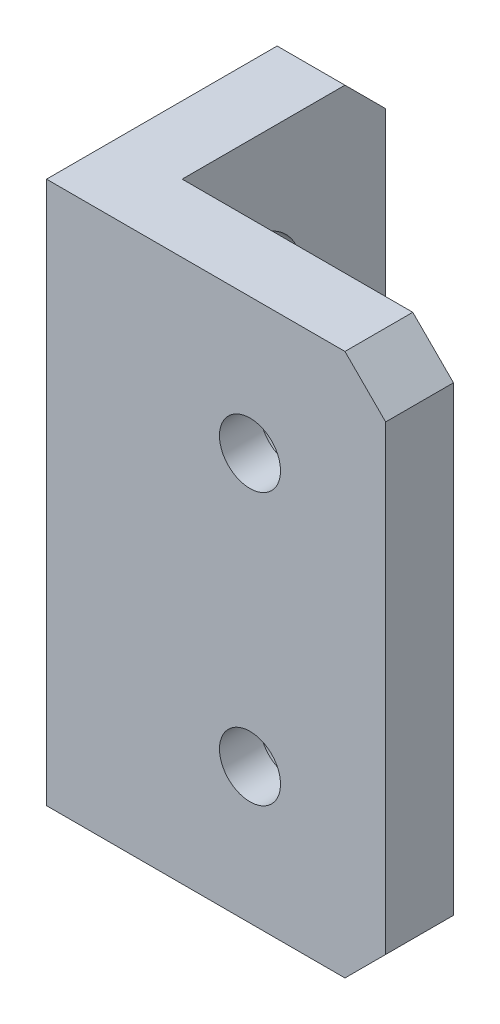
ISO-10303-21;
HEADER;
FILE_DESCRIPTION(('STEP AP214'),'2;1');
FILE_NAME('part.step','',(''),(''),'','','');
FILE_SCHEMA(('AUTOMOTIVE_DESIGN { 1 0 10303 214 1 1 1 1 }'));
ENDSEC;
DATA;
#1=APPLICATION_CONTEXT('core data for automotive mechanical design processes');
#2=APPLICATION_PROTOCOL_DEFINITION('international standard','automotive_design',2000,#1);
#3=PRODUCT_CONTEXT('',#1,'mechanical');
#4=PRODUCT('Part','Part','',(#3));
#5=PRODUCT_RELATED_PRODUCT_CATEGORY('part','',(#4));
#6=PRODUCT_DEFINITION_FORMATION('','',#4);
#7=PRODUCT_DEFINITION_CONTEXT('part definition',#1,'design');
#8=PRODUCT_DEFINITION('design','',#6,#7);
#9=PRODUCT_DEFINITION_SHAPE('','',#8);
#10=(LENGTH_UNIT() NAMED_UNIT(*) SI_UNIT(.MILLI.,.METRE.));
#11=(NAMED_UNIT(*) PLANE_ANGLE_UNIT() SI_UNIT($,.RADIAN.));
#12=(NAMED_UNIT(*) SI_UNIT($,.STERADIAN.) SOLID_ANGLE_UNIT());
#13=UNCERTAINTY_MEASURE_WITH_UNIT(LENGTH_MEASURE(1.E-05),#10,'distance_accuracy_value','');
#14=(GEOMETRIC_REPRESENTATION_CONTEXT(3) GLOBAL_UNCERTAINTY_ASSIGNED_CONTEXT((#13)) GLOBAL_UNIT_ASSIGNED_CONTEXT((#10,
#11,#12)) REPRESENTATION_CONTEXT('',''));
#15=CARTESIAN_POINT('',(0.,0.,0.));
#16=DIRECTION('',(0.,0.,1.));
#17=DIRECTION('',(1.,0.,0.));
#18=AXIS2_PLACEMENT_3D('',#15,#16,#17);
#19=CARTESIAN_POINT('',(25.001,30.,-10.));
#20=DIRECTION('',(-1.,0.,0.));
#21=DIRECTION('',(0.,0.,1.));
#22=AXIS2_PLACEMENT_3D('',#19,#20,#21);
#23=CYLINDRICAL_SURFACE('',#22,2.25);
#24=CARTESIAN_POINT('',(0.,30.,-10.));
#25=DIRECTION('',(-1.,0.,0.));
#26=DIRECTION('',(0.,0.,-1.));
#27=AXIS2_PLACEMENT_3D('',#24,#25,#26);
#28=CIRCLE('',#27,2.25);
#29=CARTESIAN_POINT('',(0.,30.,-12.25));
#30=VERTEX_POINT('',#29);
#31=EDGE_CURVE('E343',#30,#30,#28,.T.);
#32=ORIENTED_EDGE('',*,*,#31,.T.);
#33=EDGE_LOOP('',(#32));
#34=FACE_BOUND('',#33,.T.);
#35=CARTESIAN_POINT('',(3.,30.,-10.));
#36=DIRECTION('',(1.,0.,0.));
#37=DIRECTION('',(0.,0.,-1.));
#38=AXIS2_PLACEMENT_3D('',#35,#36,#37);
#39=CIRCLE('',#38,2.25);
#40=CARTESIAN_POINT('',(3.,30.,-12.25));
#41=VERTEX_POINT('',#40);
#42=EDGE_CURVE('E157',#41,#41,#39,.F.);
#43=ORIENTED_EDGE('',*,*,#42,.F.);
#44=EDGE_LOOP('',(#43));
#45=FACE_BOUND('',#44,.T.);
#46=ADVANCED_FACE('F35',(#34,#45),#23,.F.);
#47=CARTESIAN_POINT('',(15.,10.,0.00100000000000013));
#48=DIRECTION('',(0.,0.,-1.));
#49=DIRECTION('',(-1.,0.,0.));
#50=AXIS2_PLACEMENT_3D('',#47,#48,#49);
#51=CYLINDRICAL_SURFACE('',#50,2.25);
#52=CARTESIAN_POINT('',(15.,10.,0.));
#53=DIRECTION('',(0.,0.,-1.));
#54=DIRECTION('',(-1.,0.,0.));
#55=AXIS2_PLACEMENT_3D('',#52,#53,#54);
#56=CIRCLE('',#55,2.25);
#57=CARTESIAN_POINT('',(12.75,10.,0.));
#58=VERTEX_POINT('',#57);
#59=EDGE_CURVE('E340',#58,#58,#56,.F.);
#60=ORIENTED_EDGE('',*,*,#59,.T.);
#61=EDGE_LOOP('',(#60));
#62=FACE_BOUND('',#61,.T.);
#63=CARTESIAN_POINT('',(15.,10.,-3.));
#64=DIRECTION('',(0.,0.,-1.));
#65=DIRECTION('',(-1.,0.,0.));
#66=AXIS2_PLACEMENT_3D('',#63,#64,#65);
#67=CIRCLE('',#66,2.25);
#68=CARTESIAN_POINT('',(12.75,10.,-3.));
#69=VERTEX_POINT('',#68);
#70=EDGE_CURVE('E146',#69,#69,#67,.F.);
#71=ORIENTED_EDGE('',*,*,#70,.F.);
#72=EDGE_LOOP('',(#71));
#73=FACE_BOUND('',#72,.T.);
#74=ADVANCED_FACE('F243',(#62,#73),#51,.F.);
#75=CARTESIAN_POINT('',(0.,40.,0.));
#76=DIRECTION('',(1.,0.,0.));
#77=DIRECTION('',(0.,0.,-1.));
#78=AXIS2_PLACEMENT_3D('',#75,#76,#77);
#79=PLANE('',#78);
#80=CARTESIAN_POINT('',(0.,10.,-10.));
#81=DIRECTION('',(-1.,0.,0.));
#82=DIRECTION('',(0.,0.,1.));
#83=AXIS2_PLACEMENT_3D('',#80,#81,#82);
#84=CIRCLE('',#83,2.25);
#85=CARTESIAN_POINT('',(0.,10.,-7.75));
#86=VERTEX_POINT('',#85);
#87=EDGE_CURVE('E231',#86,#86,#84,.T.);
#88=ORIENTED_EDGE('',*,*,#87,.F.);
#89=EDGE_LOOP('',(#88));
#90=FACE_BOUND('',#89,.T.);
#91=ORIENTED_EDGE('',*,*,#31,.F.);
#92=EDGE_LOOP('',(#91));
#93=FACE_BOUND('',#92,.T.);
#94=DIRECTION('',(0.,0.,1.));
#95=VECTOR('',#94,1.);
#96=CARTESIAN_POINT('',(0.,40.,0.));
#97=LINE('',#96,#95);
#98=CARTESIAN_POINT('',(0.,40.,-17.));
#99=VERTEX_POINT('',#98);
#100=CARTESIAN_POINT('',(0.,40.,0.));
#101=VERTEX_POINT('',#100);
#102=EDGE_CURVE('E115',#99,#101,#97,.T.);
#103=ORIENTED_EDGE('',*,*,#102,.F.);
#104=DIRECTION('',(0.,0.707106781186548,0.707106781186547));
#105=VECTOR('',#104,1.);
#106=CARTESIAN_POINT('',(0.,40.,-17.));
#107=LINE('',#106,#105);
#108=CARTESIAN_POINT('',(0.,37.,-20.));
#109=VERTEX_POINT('',#108);
#110=EDGE_CURVE('E165',#99,#109,#107,.F.);
#111=ORIENTED_EDGE('',*,*,#110,.T.);
#112=DIRECTION('',(0.,-1.,0.));
#113=VECTOR('',#112,1.);
#114=CARTESIAN_POINT('',(0.,40.,-20.));
#115=LINE('',#114,#113);
#116=CARTESIAN_POINT('',(0.,3.00000000000001,-20.));
#117=VERTEX_POINT('',#116);
#118=EDGE_CURVE('E207',#109,#117,#115,.T.);
#119=ORIENTED_EDGE('',*,*,#118,.T.);
#120=DIRECTION('',(0.,-0.707106781186547,0.707106781186548));
#121=VECTOR('',#120,1.);
#122=CARTESIAN_POINT('',(0.,3.00000000000001,-20.));
#123=LINE('',#122,#121);
#124=CARTESIAN_POINT('',(0.,0.,-17.));
#125=VERTEX_POINT('',#124);
#126=EDGE_CURVE('E163',#117,#125,#123,.T.);
#127=ORIENTED_EDGE('',*,*,#126,.T.);
#128=DIRECTION('',(0.,0.,1.));
#129=VECTOR('',#128,1.);
#130=CARTESIAN_POINT('',(0.,0.,0.));
#131=LINE('',#130,#129);
#132=CARTESIAN_POINT('',(0.,0.,0.));
#133=VERTEX_POINT('',#132);
#134=EDGE_CURVE('E137',#125,#133,#131,.T.);
#135=ORIENTED_EDGE('',*,*,#134,.T.);
#136=DIRECTION('',(0.,-1.,0.));
#137=VECTOR('',#136,1.);
#138=CARTESIAN_POINT('',(0.,40.,0.));
#139=LINE('',#138,#137);
#140=EDGE_CURVE('E130',#101,#133,#139,.T.);
#141=ORIENTED_EDGE('',*,*,#140,.F.);
#142=EDGE_LOOP('',(#103,#111,#119,#127,#135,#141));
#143=FACE_BOUND('',#142,.T.);
#144=ADVANCED_FACE('F135',(#90,#93,#143),#79,.F.);
#145=CARTESIAN_POINT('',(0.,40.,0.));
#146=DIRECTION('',(0.,0.,-1.));
#147=DIRECTION('',(-1.,0.,0.));
#148=AXIS2_PLACEMENT_3D('',#145,#146,#147);
#149=PLANE('',#148);
#150=ORIENTED_EDGE('',*,*,#59,.F.);
#151=EDGE_LOOP('',(#150));
#152=FACE_BOUND('',#151,.T.);
#153=CARTESIAN_POINT('',(15.,30.,0.));
#154=DIRECTION('',(0.,0.,-1.));
#155=DIRECTION('',(-1.,0.,0.));
#156=AXIS2_PLACEMENT_3D('',#153,#154,#155);
#157=CIRCLE('',#156,2.25);
#158=CARTESIAN_POINT('',(12.75,30.,0.));
#159=VERTEX_POINT('',#158);
#160=EDGE_CURVE('E153',#159,#159,#157,.F.);
#161=ORIENTED_EDGE('',*,*,#160,.F.);
#162=EDGE_LOOP('',(#161));
#163=FACE_BOUND('',#162,.T.);
#164=DIRECTION('',(0.,-1.,0.));
#165=VECTOR('',#164,1.);
#166=CARTESIAN_POINT('',(25.,40.,0.));
#167=LINE('',#166,#165);
#168=CARTESIAN_POINT('',(25.,37.,0.));
#169=VERTEX_POINT('',#168);
#170=CARTESIAN_POINT('',(25.,3.00000000000001,0.));
#171=VERTEX_POINT('',#170);
#172=EDGE_CURVE('E139',#169,#171,#167,.T.);
#173=ORIENTED_EDGE('',*,*,#172,.F.);
#174=DIRECTION('',(0.707106781186547,-0.707106781186548,0.));
#175=VECTOR('',#174,1.);
#176=CARTESIAN_POINT('',(22.,40.,0.));
#177=LINE('',#176,#175);
#178=CARTESIAN_POINT('',(22.,40.,0.));
#179=VERTEX_POINT('',#178);
#180=EDGE_CURVE('E132',#169,#179,#177,.F.);
#181=ORIENTED_EDGE('',*,*,#180,.T.);
#182=DIRECTION('',(1.,0.,0.));
#183=VECTOR('',#182,1.);
#184=CARTESIAN_POINT('',(0.,40.,0.));
#185=LINE('',#184,#183);
#186=EDGE_CURVE('E120',#101,#179,#185,.T.);
#187=ORIENTED_EDGE('',*,*,#186,.F.);
#188=ORIENTED_EDGE('',*,*,#140,.T.);
#189=DIRECTION('',(1.,0.,0.));
#190=VECTOR('',#189,1.);
#191=CARTESIAN_POINT('',(0.,0.,0.));
#192=LINE('',#191,#190);
#193=CARTESIAN_POINT('',(22.,0.,0.));
#194=VERTEX_POINT('',#193);
#195=EDGE_CURVE('E230',#133,#194,#192,.T.);
#196=ORIENTED_EDGE('',*,*,#195,.T.);
#197=DIRECTION('',(0.707106781186548,0.707106781186547,0.));
#198=VECTOR('',#197,1.);
#199=CARTESIAN_POINT('',(25.,3.00000000000001,0.));
#200=LINE('',#199,#198);
#201=EDGE_CURVE('E56',#194,#171,#200,.T.);
#202=ORIENTED_EDGE('',*,*,#201,.T.);
#203=EDGE_LOOP('',(#173,#181,#187,#188,#196,#202));
#204=FACE_BOUND('',#203,.T.);
#205=ADVANCED_FACE('F129',(#152,#163,#204),#149,.F.);
#206=CARTESIAN_POINT('',(25.,40.,0.));
#207=DIRECTION('',(-1.,0.,0.));
#208=DIRECTION('',(0.,0.,1.));
#209=AXIS2_PLACEMENT_3D('',#206,#207,#208);
#210=PLANE('',#209);
#211=DIRECTION('',(0.,-1.,0.));
#212=VECTOR('',#211,1.);
#213=CARTESIAN_POINT('',(25.,40.,-5.));
#214=LINE('',#213,#212);
#215=CARTESIAN_POINT('',(25.,37.,-5.));
#216=VERTEX_POINT('',#215);
#217=CARTESIAN_POINT('',(25.,3.00000000000001,-5.));
#218=VERTEX_POINT('',#217);
#219=EDGE_CURVE('E142',#216,#218,#214,.T.);
#220=ORIENTED_EDGE('',*,*,#219,.F.);
#221=DIRECTION('',(0.,0.,1.));
#222=VECTOR('',#221,1.);
#223=CARTESIAN_POINT('',(25.,37.,0.));
#224=LINE('',#223,#222);
#225=EDGE_CURVE('E183',#216,#169,#224,.T.);
#226=ORIENTED_EDGE('',*,*,#225,.T.);
#227=ORIENTED_EDGE('',*,*,#172,.T.);
#228=DIRECTION('',(0.,0.,-1.));
#229=VECTOR('',#228,1.);
#230=CARTESIAN_POINT('',(25.,3.00000000000001,-5.));
#231=LINE('',#230,#229);
#232=EDGE_CURVE('E180',#171,#218,#231,.T.);
#233=ORIENTED_EDGE('',*,*,#232,.T.);
#234=EDGE_LOOP('',(#220,#226,#227,#233));
#235=FACE_BOUND('',#234,.T.);
#236=ADVANCED_FACE('F223',(#235),#210,.F.);
#237=CARTESIAN_POINT('',(5.,40.,-5.));
#238=DIRECTION('',(0.,0.,1.));
#239=DIRECTION('',(1.,0.,0.));
#240=AXIS2_PLACEMENT_3D('',#237,#238,#239);
#241=PLANE('',#240);
#242=CARTESIAN_POINT('',(15.,10.,-5.));
#243=DIRECTION('',(0.,0.,-1.));
#244=DIRECTION('',(-1.,0.,0.));
#245=AXIS2_PLACEMENT_3D('',#242,#243,#244);
#246=CIRCLE('',#245,3.75);
#247=CARTESIAN_POINT('',(11.25,10.,-5.));
#248=VERTEX_POINT('',#247);
#249=EDGE_CURVE('E358',#248,#248,#246,.T.);
#250=ORIENTED_EDGE('',*,*,#249,.F.);
#251=EDGE_LOOP('',(#250));
#252=FACE_BOUND('',#251,.T.);
#253=CARTESIAN_POINT('',(15.,30.,-5.));
#254=DIRECTION('',(0.,0.,-1.));
#255=DIRECTION('',(1.,0.,0.));
#256=AXIS2_PLACEMENT_3D('',#253,#254,#255);
#257=CIRCLE('',#256,3.75);
#258=CARTESIAN_POINT('',(18.75,30.,-5.));
#259=VERTEX_POINT('',#258);
#260=EDGE_CURVE('E160',#259,#259,#257,.T.);
#261=ORIENTED_EDGE('',*,*,#260,.F.);
#262=EDGE_LOOP('',(#261));
#263=FACE_BOUND('',#262,.T.);
#264=DIRECTION('',(-1.,0.,0.));
#265=VECTOR('',#264,1.);
#266=CARTESIAN_POINT('',(5.,40.,-5.));
#267=LINE('',#266,#265);
#268=CARTESIAN_POINT('',(22.,40.,-5.));
#269=VERTEX_POINT('',#268);
#270=CARTESIAN_POINT('',(5.,40.,-5.));
#271=VERTEX_POINT('',#270);
#272=EDGE_CURVE('E133',#269,#271,#267,.T.);
#273=ORIENTED_EDGE('',*,*,#272,.F.);
#274=DIRECTION('',(-0.707106781186547,0.707106781186548,0.));
#275=VECTOR('',#274,1.);
#276=CARTESIAN_POINT('',(22.,40.,-5.));
#277=LINE('',#276,#275);
#278=EDGE_CURVE('E178',#269,#216,#277,.F.);
#279=ORIENTED_EDGE('',*,*,#278,.T.);
#280=ORIENTED_EDGE('',*,*,#219,.T.);
#281=DIRECTION('',(-0.707106781186548,-0.707106781186547,0.));
#282=VECTOR('',#281,1.);
#283=CARTESIAN_POINT('',(25.,3.00000000000001,-5.));
#284=LINE('',#283,#282);
#285=CARTESIAN_POINT('',(22.,0.,-5.));
#286=VERTEX_POINT('',#285);
#287=EDGE_CURVE('E176',#218,#286,#284,.T.);
#288=ORIENTED_EDGE('',*,*,#287,.T.);
#289=DIRECTION('',(-1.,0.,0.));
#290=VECTOR('',#289,1.);
#291=CARTESIAN_POINT('',(5.,0.,-5.));
#292=LINE('',#291,#290);
#293=CARTESIAN_POINT('',(5.,0.,-5.));
#294=VERTEX_POINT('',#293);
#295=EDGE_CURVE('E200',#286,#294,#292,.T.);
#296=ORIENTED_EDGE('',*,*,#295,.T.);
#297=DIRECTION('',(0.,-1.,0.));
#298=VECTOR('',#297,1.);
#299=CARTESIAN_POINT('',(5.,40.,-5.));
#300=LINE('',#299,#298);
#301=EDGE_CURVE('E199',#271,#294,#300,.T.);
#302=ORIENTED_EDGE('',*,*,#301,.F.);
#303=EDGE_LOOP('',(#273,#279,#280,#288,#296,#302));
#304=FACE_BOUND('',#303,.T.);
#305=ADVANCED_FACE('F220',(#252,#263,#304),#241,.F.);
#306=CARTESIAN_POINT('',(5.,40.,-5.));
#307=DIRECTION('',(-1.,0.,0.));
#308=DIRECTION('',(0.,0.,1.));
#309=AXIS2_PLACEMENT_3D('',#306,#307,#308);
#310=PLANE('',#309);
#311=CARTESIAN_POINT('',(5.,30.,-10.));
#312=DIRECTION('',(1.,0.,0.));
#313=DIRECTION('',(0.,0.,-1.));
#314=AXIS2_PLACEMENT_3D('',#311,#312,#313);
#315=CIRCLE('',#314,3.75);
#316=CARTESIAN_POINT('',(5.,30.,-13.75));
#317=VERTEX_POINT('',#316);
#318=EDGE_CURVE('E369',#317,#317,#315,.T.);
#319=ORIENTED_EDGE('',*,*,#318,.F.);
#320=EDGE_LOOP('',(#319));
#321=FACE_BOUND('',#320,.T.);
#322=CARTESIAN_POINT('',(5.,10.,-10.));
#323=DIRECTION('',(1.,0.,0.));
#324=DIRECTION('',(0.,0.,1.));
#325=AXIS2_PLACEMENT_3D('',#322,#323,#324);
#326=CIRCLE('',#325,3.75);
#327=CARTESIAN_POINT('',(5.,10.,-6.25));
#328=VERTEX_POINT('',#327);
#329=EDGE_CURVE('E363',#328,#328,#326,.T.);
#330=ORIENTED_EDGE('',*,*,#329,.F.);
#331=EDGE_LOOP('',(#330));
#332=FACE_BOUND('',#331,.T.);
#333=DIRECTION('',(0.,-1.,0.));
#334=VECTOR('',#333,1.);
#335=CARTESIAN_POINT('',(5.,40.,-20.));
#336=LINE('',#335,#334);
#337=CARTESIAN_POINT('',(5.,37.,-20.));
#338=VERTEX_POINT('',#337);
#339=CARTESIAN_POINT('',(5.,3.00000000000001,-20.));
#340=VERTEX_POINT('',#339);
#341=EDGE_CURVE('E209',#338,#340,#336,.T.);
#342=ORIENTED_EDGE('',*,*,#341,.F.);
#343=DIRECTION('',(0.,-0.707106781186548,-0.707106781186547));
#344=VECTOR('',#343,1.);
#345=CARTESIAN_POINT('',(5.,40.,-17.));
#346=LINE('',#345,#344);
#347=CARTESIAN_POINT('',(5.,40.,-17.));
#348=VERTEX_POINT('',#347);
#349=EDGE_CURVE('E174',#338,#348,#346,.F.);
#350=ORIENTED_EDGE('',*,*,#349,.T.);
#351=DIRECTION('',(0.,0.,-1.));
#352=VECTOR('',#351,1.);
#353=CARTESIAN_POINT('',(5.,40.,-5.));
#354=LINE('',#353,#352);
#355=EDGE_CURVE('E210',#271,#348,#354,.T.);
#356=ORIENTED_EDGE('',*,*,#355,.F.);
#357=ORIENTED_EDGE('',*,*,#301,.T.);
#358=DIRECTION('',(0.,0.,-1.));
#359=VECTOR('',#358,1.);
#360=CARTESIAN_POINT('',(5.,0.,-5.));
#361=LINE('',#360,#359);
#362=CARTESIAN_POINT('',(5.,0.,-17.));
#363=VERTEX_POINT('',#362);
#364=EDGE_CURVE('E126',#294,#363,#361,.T.);
#365=ORIENTED_EDGE('',*,*,#364,.T.);
#366=DIRECTION('',(0.,0.707106781186547,-0.707106781186548));
#367=VECTOR('',#366,1.);
#368=CARTESIAN_POINT('',(5.,3.00000000000001,-20.));
#369=LINE('',#368,#367);
#370=EDGE_CURVE('E172',#363,#340,#369,.T.);
#371=ORIENTED_EDGE('',*,*,#370,.T.);
#372=EDGE_LOOP('',(#342,#350,#356,#357,#365,#371));
#373=FACE_BOUND('',#372,.T.);
#374=ADVANCED_FACE('F195',(#321,#332,#373),#310,.F.);
#375=CARTESIAN_POINT('',(0.,40.,-20.));
#376=DIRECTION('',(0.,0.,1.));
#377=DIRECTION('',(1.,0.,0.));
#378=AXIS2_PLACEMENT_3D('',#375,#376,#377);
#379=PLANE('',#378);
#380=ORIENTED_EDGE('',*,*,#118,.F.);
#381=DIRECTION('',(1.,0.,0.));
#382=VECTOR('',#381,1.);
#383=CARTESIAN_POINT('',(0.,37.,-20.));
#384=LINE('',#383,#382);
#385=EDGE_CURVE('E170',#109,#338,#384,.T.);
#386=ORIENTED_EDGE('',*,*,#385,.T.);
#387=ORIENTED_EDGE('',*,*,#341,.T.);
#388=DIRECTION('',(-1.,0.,0.));
#389=VECTOR('',#388,1.);
#390=CARTESIAN_POINT('',(0.,3.00000000000001,-20.));
#391=LINE('',#390,#389);
#392=EDGE_CURVE('E167',#340,#117,#391,.T.);
#393=ORIENTED_EDGE('',*,*,#392,.T.);
#394=EDGE_LOOP('',(#380,#386,#387,#393));
#395=FACE_BOUND('',#394,.T.);
#396=ADVANCED_FACE('F206',(#395),#379,.F.);
#397=CARTESIAN_POINT('',(0.,40.,0.));
#398=DIRECTION('',(0.,-1.,0.));
#399=DIRECTION('',(0.,0.,-1.));
#400=AXIS2_PLACEMENT_3D('',#397,#398,#399);
#401=PLANE('',#400);
#402=ORIENTED_EDGE('',*,*,#355,.T.);
#403=DIRECTION('',(-1.,0.,0.));
#404=VECTOR('',#403,1.);
#405=CARTESIAN_POINT('',(0.,40.,-17.));
#406=LINE('',#405,#404);
#407=EDGE_CURVE('E123',#348,#99,#406,.T.);
#408=ORIENTED_EDGE('',*,*,#407,.T.);
#409=ORIENTED_EDGE('',*,*,#102,.T.);
#410=ORIENTED_EDGE('',*,*,#186,.T.);
#411=DIRECTION('',(0.,0.,-1.));
#412=VECTOR('',#411,1.);
#413=CARTESIAN_POINT('',(22.,40.,0.));
#414=LINE('',#413,#412);
#415=EDGE_CURVE('E138',#179,#269,#414,.T.);
#416=ORIENTED_EDGE('',*,*,#415,.T.);
#417=ORIENTED_EDGE('',*,*,#272,.T.);
#418=EDGE_LOOP('',(#402,#408,#409,#410,#416,#417));
#419=FACE_BOUND('',#418,.T.);
#420=ADVANCED_FACE('F118',(#419),#401,.F.);
#421=CARTESIAN_POINT('',(0.,0.,0.));
#422=DIRECTION('',(0.,-1.,0.));
#423=DIRECTION('',(0.,0.,-1.));
#424=AXIS2_PLACEMENT_3D('',#421,#422,#423);
#425=PLANE('',#424);
#426=ORIENTED_EDGE('',*,*,#295,.F.);
#427=DIRECTION('',(0.,0.,1.));
#428=VECTOR('',#427,1.);
#429=CARTESIAN_POINT('',(22.,0.,0.));
#430=LINE('',#429,#428);
#431=EDGE_CURVE('E11',#286,#194,#430,.T.);
#432=ORIENTED_EDGE('',*,*,#431,.T.);
#433=ORIENTED_EDGE('',*,*,#195,.F.);
#434=ORIENTED_EDGE('',*,*,#134,.F.);
#435=DIRECTION('',(1.,0.,0.));
#436=VECTOR('',#435,1.);
#437=CARTESIAN_POINT('',(5.,0.,-17.));
#438=LINE('',#437,#436);
#439=EDGE_CURVE('E44',#125,#363,#438,.T.);
#440=ORIENTED_EDGE('',*,*,#439,.T.);
#441=ORIENTED_EDGE('',*,*,#364,.F.);
#442=EDGE_LOOP('',(#426,#432,#433,#434,#440,#441));
#443=FACE_BOUND('',#442,.T.);
#444=ADVANCED_FACE('F189',(#443),#425,.T.);
#445=CARTESIAN_POINT('',(25.001,10.,-10.));
#446=DIRECTION('',(-1.,0.,0.));
#447=DIRECTION('',(0.,0.,1.));
#448=AXIS2_PLACEMENT_3D('',#445,#446,#447);
#449=CYLINDRICAL_SURFACE('',#448,2.25);
#450=CARTESIAN_POINT('',(3.,10.,-10.));
#451=DIRECTION('',(-1.,0.,0.));
#452=DIRECTION('',(0.,0.,1.));
#453=AXIS2_PLACEMENT_3D('',#450,#451,#452);
#454=CIRCLE('',#453,2.25);
#455=CARTESIAN_POINT('',(3.,10.,-7.75));
#456=VERTEX_POINT('',#455);
#457=EDGE_CURVE('E154',#456,#456,#454,.F.);
#458=ORIENTED_EDGE('',*,*,#457,.T.);
#459=EDGE_LOOP('',(#458));
#460=FACE_BOUND('',#459,.T.);
#461=ORIENTED_EDGE('',*,*,#87,.T.);
#462=EDGE_LOOP('',(#461));
#463=FACE_BOUND('',#462,.T.);
#464=ADVANCED_FACE('F255',(#460,#463),#449,.F.);
#465=CARTESIAN_POINT('',(15.,30.,0.00100000000000013));
#466=DIRECTION('',(0.,0.,-1.));
#467=DIRECTION('',(-1.,0.,0.));
#468=AXIS2_PLACEMENT_3D('',#465,#466,#467);
#469=CYLINDRICAL_SURFACE('',#468,2.25);
#470=CARTESIAN_POINT('',(15.,30.,-3.));
#471=DIRECTION('',(0.,0.,1.));
#472=DIRECTION('',(1.,0.,0.));
#473=AXIS2_PLACEMENT_3D('',#470,#471,#472);
#474=CIRCLE('',#473,2.25);
#475=CARTESIAN_POINT('',(17.25,30.,-3.));
#476=VERTEX_POINT('',#475);
#477=EDGE_CURVE('E149',#476,#476,#474,.F.);
#478=ORIENTED_EDGE('',*,*,#477,.T.);
#479=EDGE_LOOP('',(#478));
#480=FACE_BOUND('',#479,.T.);
#481=ORIENTED_EDGE('',*,*,#160,.T.);
#482=EDGE_LOOP('',(#481));
#483=FACE_BOUND('',#482,.T.);
#484=ADVANCED_FACE('F318',(#480,#483),#469,.F.);
#485=CARTESIAN_POINT('',(15.,10.,-3.));
#486=DIRECTION('',(0.,0.,-1.));
#487=DIRECTION('',(-1.,0.,0.));
#488=AXIS2_PLACEMENT_3D('',#485,#486,#487);
#489=PLANE('',#488);
#490=CARTESIAN_POINT('',(15.,10.,-3.));
#491=DIRECTION('',(0.,0.,-1.));
#492=DIRECTION('',(-1.,0.,0.));
#493=AXIS2_PLACEMENT_3D('',#490,#491,#492);
#494=CIRCLE('',#493,3.75);
#495=CARTESIAN_POINT('',(11.25,10.,-3.));
#496=VERTEX_POINT('',#495);
#497=EDGE_CURVE('E150',#496,#496,#494,.T.);
#498=ORIENTED_EDGE('',*,*,#497,.T.);
#499=EDGE_LOOP('',(#498));
#500=FACE_BOUND('',#499,.T.);
#501=ORIENTED_EDGE('',*,*,#70,.T.);
#502=EDGE_LOOP('',(#501));
#503=FACE_BOUND('',#502,.T.);
#504=ADVANCED_FACE('F314',(#500,#503),#489,.T.);
#505=CARTESIAN_POINT('',(15.,10.,-3.));
#506=DIRECTION('',(0.,0.,-1.));
#507=DIRECTION('',(-1.,0.,0.));
#508=AXIS2_PLACEMENT_3D('',#505,#506,#507);
#509=CYLINDRICAL_SURFACE('',#508,3.75);
#510=ORIENTED_EDGE('',*,*,#497,.F.);
#511=EDGE_LOOP('',(#510));
#512=FACE_BOUND('',#511,.T.);
#513=ORIENTED_EDGE('',*,*,#249,.T.);
#514=EDGE_LOOP('',(#513));
#515=FACE_BOUND('',#514,.T.);
#516=ADVANCED_FACE('F317',(#512,#515),#509,.F.);
#517=CARTESIAN_POINT('',(15.,30.,-3.));
#518=DIRECTION('',(0.,0.,1.));
#519=DIRECTION('',(1.,0.,0.));
#520=AXIS2_PLACEMENT_3D('',#517,#518,#519);
#521=PLANE('',#520);
#522=CARTESIAN_POINT('',(15.,30.,-3.));
#523=DIRECTION('',(0.,0.,-1.));
#524=DIRECTION('',(1.,0.,0.));
#525=AXIS2_PLACEMENT_3D('',#522,#523,#524);
#526=CIRCLE('',#525,3.75);
#527=CARTESIAN_POINT('',(18.75,30.,-3.));
#528=VERTEX_POINT('',#527);
#529=EDGE_CURVE('E355',#528,#528,#526,.T.);
#530=ORIENTED_EDGE('',*,*,#529,.T.);
#531=EDGE_LOOP('',(#530));
#532=FACE_BOUND('',#531,.T.);
#533=ORIENTED_EDGE('',*,*,#477,.F.);
#534=EDGE_LOOP('',(#533));
#535=FACE_BOUND('',#534,.T.);
#536=ADVANCED_FACE('F322',(#532,#535),#521,.F.);
#537=CARTESIAN_POINT('',(15.,30.,-3.));
#538=DIRECTION('',(0.,0.,-1.));
#539=DIRECTION('',(-1.,0.,0.));
#540=AXIS2_PLACEMENT_3D('',#537,#538,#539);
#541=CYLINDRICAL_SURFACE('',#540,3.75);
#542=ORIENTED_EDGE('',*,*,#529,.F.);
#543=EDGE_LOOP('',(#542));
#544=FACE_BOUND('',#543,.T.);
#545=ORIENTED_EDGE('',*,*,#260,.T.);
#546=EDGE_LOOP('',(#545));
#547=FACE_BOUND('',#546,.T.);
#548=ADVANCED_FACE('F309',(#544,#547),#541,.F.);
#549=CARTESIAN_POINT('',(3.,10.,-10.));
#550=DIRECTION('',(-1.,0.,0.));
#551=DIRECTION('',(0.,0.,1.));
#552=AXIS2_PLACEMENT_3D('',#549,#550,#551);
#553=PLANE('',#552);
#554=CARTESIAN_POINT('',(3.,10.,-10.));
#555=DIRECTION('',(1.,0.,0.));
#556=DIRECTION('',(0.,0.,1.));
#557=AXIS2_PLACEMENT_3D('',#554,#555,#556);
#558=CIRCLE('',#557,3.75);
#559=CARTESIAN_POINT('',(3.,10.,-6.25));
#560=VERTEX_POINT('',#559);
#561=EDGE_CURVE('E366',#560,#560,#558,.T.);
#562=ORIENTED_EDGE('',*,*,#561,.T.);
#563=EDGE_LOOP('',(#562));
#564=FACE_BOUND('',#563,.T.);
#565=ORIENTED_EDGE('',*,*,#457,.F.);
#566=EDGE_LOOP('',(#565));
#567=FACE_BOUND('',#566,.T.);
#568=ADVANCED_FACE('F306',(#564,#567),#553,.F.);
#569=CARTESIAN_POINT('',(3.,10.,-10.));
#570=DIRECTION('',(1.,0.,0.));
#571=DIRECTION('',(0.,0.,-1.));
#572=AXIS2_PLACEMENT_3D('',#569,#570,#571);
#573=CYLINDRICAL_SURFACE('',#572,3.75);
#574=ORIENTED_EDGE('',*,*,#561,.F.);
#575=EDGE_LOOP('',(#574));
#576=FACE_BOUND('',#575,.T.);
#577=ORIENTED_EDGE('',*,*,#329,.T.);
#578=EDGE_LOOP('',(#577));
#579=FACE_BOUND('',#578,.T.);
#580=ADVANCED_FACE('F300',(#576,#579),#573,.F.);
#581=CARTESIAN_POINT('',(3.,30.,-10.));
#582=DIRECTION('',(1.,0.,0.));
#583=DIRECTION('',(0.,0.,-1.));
#584=AXIS2_PLACEMENT_3D('',#581,#582,#583);
#585=PLANE('',#584);
#586=CARTESIAN_POINT('',(3.,30.,-10.));
#587=DIRECTION('',(1.,0.,0.));
#588=DIRECTION('',(0.,0.,-1.));
#589=AXIS2_PLACEMENT_3D('',#586,#587,#588);
#590=CIRCLE('',#589,3.75);
#591=CARTESIAN_POINT('',(3.,30.,-13.75));
#592=VERTEX_POINT('',#591);
#593=EDGE_CURVE('E158',#592,#592,#590,.T.);
#594=ORIENTED_EDGE('',*,*,#593,.T.);
#595=EDGE_LOOP('',(#594));
#596=FACE_BOUND('',#595,.T.);
#597=ORIENTED_EDGE('',*,*,#42,.T.);
#598=EDGE_LOOP('',(#597));
#599=FACE_BOUND('',#598,.T.);
#600=ADVANCED_FACE('F293',(#596,#599),#585,.T.);
#601=CARTESIAN_POINT('',(3.,30.,-10.));
#602=DIRECTION('',(1.,0.,0.));
#603=DIRECTION('',(0.,0.,-1.));
#604=AXIS2_PLACEMENT_3D('',#601,#602,#603);
#605=CYLINDRICAL_SURFACE('',#604,3.75);
#606=ORIENTED_EDGE('',*,*,#593,.F.);
#607=EDGE_LOOP('',(#606));
#608=FACE_BOUND('',#607,.T.);
#609=ORIENTED_EDGE('',*,*,#318,.T.);
#610=EDGE_LOOP('',(#609));
#611=FACE_BOUND('',#610,.T.);
#612=ADVANCED_FACE('F282',(#608,#611),#605,.F.);
#613=CARTESIAN_POINT('',(0.,40.,-17.));
#614=DIRECTION('',(0.,-0.707106781186547,0.707106781186548));
#615=DIRECTION('',(-1.,0.,0.));
#616=AXIS2_PLACEMENT_3D('',#613,#614,#615);
#617=PLANE('',#616);
#618=ORIENTED_EDGE('',*,*,#349,.F.);
#619=ORIENTED_EDGE('',*,*,#385,.F.);
#620=ORIENTED_EDGE('',*,*,#110,.F.);
#621=ORIENTED_EDGE('',*,*,#407,.F.);
#622=EDGE_LOOP('',(#618,#619,#620,#621));
#623=FACE_BOUND('',#622,.T.);
#624=ADVANCED_FACE('F239',(#623),#617,.F.);
#625=CARTESIAN_POINT('',(22.,40.,0.));
#626=DIRECTION('',(-0.707106781186548,-0.707106781186547,0.));
#627=DIRECTION('',(0.,0.,-1.));
#628=AXIS2_PLACEMENT_3D('',#625,#626,#627);
#629=PLANE('',#628);
#630=ORIENTED_EDGE('',*,*,#180,.F.);
#631=ORIENTED_EDGE('',*,*,#225,.F.);
#632=ORIENTED_EDGE('',*,*,#278,.F.);
#633=ORIENTED_EDGE('',*,*,#415,.F.);
#634=EDGE_LOOP('',(#630,#631,#632,#633));
#635=FACE_BOUND('',#634,.T.);
#636=ADVANCED_FACE('F226',(#635),#629,.F.);
#637=CARTESIAN_POINT('',(25.,3.00000000000001,0.));
#638=DIRECTION('',(0.707106781186547,-0.707106781186548,0.));
#639=DIRECTION('',(0.,0.,1.));
#640=AXIS2_PLACEMENT_3D('',#637,#638,#639);
#641=PLANE('',#640);
#642=ORIENTED_EDGE('',*,*,#201,.F.);
#643=ORIENTED_EDGE('',*,*,#431,.F.);
#644=ORIENTED_EDGE('',*,*,#287,.F.);
#645=ORIENTED_EDGE('',*,*,#232,.F.);
#646=EDGE_LOOP('',(#642,#643,#644,#645));
#647=FACE_BOUND('',#646,.T.);
#648=ADVANCED_FACE('F233',(#647),#641,.T.);
#649=CARTESIAN_POINT('',(0.,3.00000000000001,-20.));
#650=DIRECTION('',(0.,-0.707106781186548,-0.707106781186547));
#651=DIRECTION('',(1.,0.,0.));
#652=AXIS2_PLACEMENT_3D('',#649,#650,#651);
#653=PLANE('',#652);
#654=ORIENTED_EDGE('',*,*,#370,.F.);
#655=ORIENTED_EDGE('',*,*,#439,.F.);
#656=ORIENTED_EDGE('',*,*,#126,.F.);
#657=ORIENTED_EDGE('',*,*,#392,.F.);
#658=EDGE_LOOP('',(#654,#655,#656,#657));
#659=FACE_BOUND('',#658,.T.);
#660=ADVANCED_FACE('F38',(#659),#653,.T.);
#661=CLOSED_SHELL('',(#46,#74,#144,#205,#236,#305,#374,#396,#420,#444,#464,#484,#504,#516,#536,
#548,#568,#580,#600,#612,#624,#636,#648,#660));
#662=MANIFOLD_SOLID_BREP('B2',#661);
#663=ADVANCED_BREP_SHAPE_REPRESENTATION('',(#18,#662),#14);
#664=SHAPE_DEFINITION_REPRESENTATION(#9,#663);
ENDSEC;
END-ISO-10303-21;
